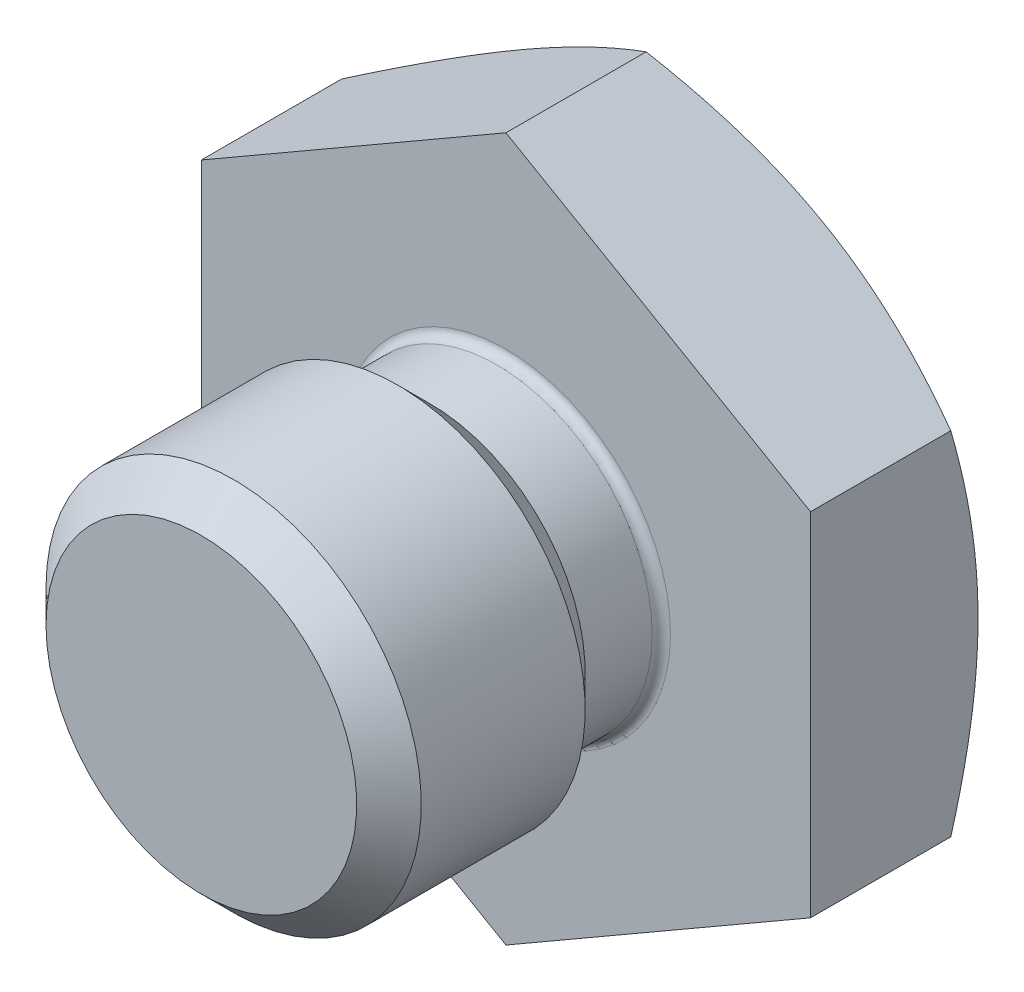
ISO-10303-21;
HEADER;
FILE_DESCRIPTION(('STEP AP214'),'2;1');
FILE_NAME('part.step','',(''),(''),'','','');
FILE_SCHEMA(('AUTOMOTIVE_DESIGN { 1 0 10303 214 1 1 1 1 }'));
ENDSEC;
DATA;
#1=APPLICATION_CONTEXT('core data for automotive mechanical design processes');
#2=APPLICATION_PROTOCOL_DEFINITION('international standard','automotive_design',2000,#1);
#3=PRODUCT_CONTEXT('',#1,'mechanical');
#4=PRODUCT('Part','Part','',(#3));
#5=PRODUCT_RELATED_PRODUCT_CATEGORY('part','',(#4));
#6=PRODUCT_DEFINITION_FORMATION('','',#4);
#7=PRODUCT_DEFINITION_CONTEXT('part definition',#1,'design');
#8=PRODUCT_DEFINITION('design','',#6,#7);
#9=PRODUCT_DEFINITION_SHAPE('','',#8);
#10=(LENGTH_UNIT() NAMED_UNIT(*) SI_UNIT(.MILLI.,.METRE.));
#11=(NAMED_UNIT(*) PLANE_ANGLE_UNIT() SI_UNIT($,.RADIAN.));
#12=(NAMED_UNIT(*) SI_UNIT($,.STERADIAN.) SOLID_ANGLE_UNIT());
#13=UNCERTAINTY_MEASURE_WITH_UNIT(LENGTH_MEASURE(1.E-05),#10,'distance_accuracy_value','');
#14=(GEOMETRIC_REPRESENTATION_CONTEXT(3) GLOBAL_UNCERTAINTY_ASSIGNED_CONTEXT((#13)) GLOBAL_UNIT_ASSIGNED_CONTEXT((#10,
#11,#12)) REPRESENTATION_CONTEXT('',''));
#15=CARTESIAN_POINT('',(0.,0.,0.));
#16=DIRECTION('',(0.,0.,1.));
#17=DIRECTION('',(1.,0.,0.));
#18=AXIS2_PLACEMENT_3D('',#15,#16,#17);
#19=CARTESIAN_POINT('',(0.,24.7927379627619,0.));
#20=DIRECTION('',(0.,0.,1.));
#21=DIRECTION('',(1.,0.,0.));
#22=AXIS2_PLACEMENT_3D('',#19,#20,#21);
#23=PLANE('',#22);
#24=CARTESIAN_POINT('',(0.,0.,0.));
#25=DIRECTION('',(0.,0.,1.));
#26=DIRECTION('',(1.,0.,0.));
#27=AXIS2_PLACEMENT_3D('',#24,#25,#26);
#28=CIRCLE('',#27,6.858);
#29=CARTESIAN_POINT('',(6.858,0.,0.));
#30=VERTEX_POINT('',#29);
#31=EDGE_CURVE('E42',#30,#30,#28,.F.);
#32=ORIENTED_EDGE('',*,*,#31,.T.);
#33=EDGE_LOOP('',(#32));
#34=FACE_BOUND('',#33,.T.);
#35=DIRECTION('',(0.,1.,0.));
#36=VECTOR('',#35,1.);
#37=CARTESIAN_POINT('',(12.7,-7.33234841870825,0.));
#38=LINE('',#37,#36);
#39=CARTESIAN_POINT('',(12.7,-7.33234841870825,0.));
#40=VERTEX_POINT('',#39);
#41=CARTESIAN_POINT('',(12.7,7.33234841870826,0.));
#42=VERTEX_POINT('',#41);
#43=EDGE_CURVE('E115',#40,#42,#38,.T.);
#44=ORIENTED_EDGE('',*,*,#43,.T.);
#45=DIRECTION('',(-0.866025403784439,0.5,0.));
#46=VECTOR('',#45,1.);
#47=CARTESIAN_POINT('',(12.7,7.33234841870826,0.));
#48=LINE('',#47,#46);
#49=CARTESIAN_POINT('',(0.,14.6646968374165,0.));
#50=VERTEX_POINT('',#49);
#51=EDGE_CURVE('E110',#42,#50,#48,.T.);
#52=ORIENTED_EDGE('',*,*,#51,.T.);
#53=DIRECTION('',(-0.866025403784439,-0.5,0.));
#54=VECTOR('',#53,1.);
#55=CARTESIAN_POINT('',(0.,14.6646968374165,0.));
#56=LINE('',#55,#54);
#57=CARTESIAN_POINT('',(-12.7,7.33234841870826,0.));
#58=VERTEX_POINT('',#57);
#59=EDGE_CURVE('E108',#50,#58,#56,.T.);
#60=ORIENTED_EDGE('',*,*,#59,.T.);
#61=DIRECTION('',(0.,-1.,0.));
#62=VECTOR('',#61,1.);
#63=CARTESIAN_POINT('',(-12.7,7.33234841870825,0.));
#64=LINE('',#63,#62);
#65=CARTESIAN_POINT('',(-12.7,-7.33234841870825,0.));
#66=VERTEX_POINT('',#65);
#67=EDGE_CURVE('E57',#58,#66,#64,.T.);
#68=ORIENTED_EDGE('',*,*,#67,.T.);
#69=DIRECTION('',(0.866025403784438,-0.5,0.));
#70=VECTOR('',#69,1.);
#71=CARTESIAN_POINT('',(-12.7,-7.33234841870825,0.));
#72=LINE('',#71,#70);
#73=CARTESIAN_POINT('',(0.,-14.6646968374165,0.));
#74=VERTEX_POINT('',#73);
#75=EDGE_CURVE('E97',#66,#74,#72,.T.);
#76=ORIENTED_EDGE('',*,*,#75,.T.);
#77=DIRECTION('',(0.866025403784439,0.5,0.));
#78=VECTOR('',#77,1.);
#79=CARTESIAN_POINT('',(0.,-14.6646968374165,0.));
#80=LINE('',#79,#78);
#81=EDGE_CURVE('E103',#74,#40,#80,.T.);
#82=ORIENTED_EDGE('',*,*,#81,.T.);
#83=EDGE_LOOP('',(#44,#52,#60,#68,#76,#82));
#84=FACE_BOUND('',#83,.T.);
#85=ADVANCED_FACE('F34',(#34,#84),#23,.T.);
#86=CARTESIAN_POINT('',(0.,0.,0.));
#87=DIRECTION('',(0.,0.,-1.));
#88=DIRECTION('',(-1.,0.,0.));
#89=AXIS2_PLACEMENT_3D('',#86,#87,#88);
#90=CYLINDRICAL_SURFACE('',#89,6.477);
#91=CARTESIAN_POINT('',(0.,0.,0.380999999999999));
#92=DIRECTION('',(0.,0.,1.));
#93=DIRECTION('',(1.,0.,0.));
#94=AXIS2_PLACEMENT_3D('',#91,#92,#93);
#95=CIRCLE('',#94,6.477);
#96=CARTESIAN_POINT('',(6.477,0.,0.380999999999999));
#97=VERTEX_POINT('',#96);
#98=EDGE_CURVE('E12',#97,#97,#95,.T.);
#99=ORIENTED_EDGE('',*,*,#98,.T.);
#100=EDGE_LOOP('',(#99));
#101=FACE_BOUND('',#100,.T.);
#102=CARTESIAN_POINT('',(0.,0.,3.175));
#103=DIRECTION('',(0.,0.,-1.));
#104=DIRECTION('',(-1.,0.,0.));
#105=AXIS2_PLACEMENT_3D('',#102,#103,#104);
#106=CIRCLE('',#105,6.477);
#107=CARTESIAN_POINT('',(-6.477,0.,3.175));
#108=VERTEX_POINT('',#107);
#109=EDGE_CURVE('E180',#108,#108,#106,.T.);
#110=ORIENTED_EDGE('',*,*,#109,.T.);
#111=EDGE_LOOP('',(#110));
#112=FACE_BOUND('',#111,.T.);
#113=ADVANCED_FACE('F194',(#101,#112),#90,.T.);
#114=CARTESIAN_POINT('',(0.,0.,3.175));
#115=DIRECTION('',(0.,0.,1.));
#116=DIRECTION('',(1.,0.,0.));
#117=AXIS2_PLACEMENT_3D('',#114,#115,#116);
#118=CONICAL_SURFACE('',#117,6.477,0.785398163397446);
#119=CARTESIAN_POINT('',(0.,0.,4.5212));
#120=DIRECTION('',(0.,0.,-1.));
#121=DIRECTION('',(-1.,0.,0.));
#122=AXIS2_PLACEMENT_3D('',#119,#120,#121);
#123=CIRCLE('',#122,7.8232);
#124=CARTESIAN_POINT('',(-7.8232,0.,4.5212));
#125=VERTEX_POINT('',#124);
#126=EDGE_CURVE('E177',#125,#125,#123,.T.);
#127=ORIENTED_EDGE('',*,*,#126,.T.);
#128=EDGE_LOOP('',(#127));
#129=FACE_BOUND('',#128,.T.);
#130=ORIENTED_EDGE('',*,*,#109,.F.);
#131=EDGE_LOOP('',(#130));
#132=FACE_BOUND('',#131,.T.);
#133=ADVANCED_FACE('F198',(#129,#132),#118,.T.);
#134=CARTESIAN_POINT('',(0.,0.,0.));
#135=DIRECTION('',(0.,0.,-1.));
#136=DIRECTION('',(-1.,0.,0.));
#137=AXIS2_PLACEMENT_3D('',#134,#135,#136);
#138=CYLINDRICAL_SURFACE('',#137,7.8232);
#139=CARTESIAN_POINT('',(0.,0.,11.3538));
#140=DIRECTION('',(0.,0.,-1.));
#141=DIRECTION('',(-1.,0.,0.));
#142=AXIS2_PLACEMENT_3D('',#139,#140,#141);
#143=CIRCLE('',#142,7.8232);
#144=CARTESIAN_POINT('',(-7.8232,0.,11.3538));
#145=VERTEX_POINT('',#144);
#146=EDGE_CURVE('E174',#145,#145,#143,.T.);
#147=ORIENTED_EDGE('',*,*,#146,.T.);
#148=EDGE_LOOP('',(#147));
#149=FACE_BOUND('',#148,.T.);
#150=ORIENTED_EDGE('',*,*,#126,.F.);
#151=EDGE_LOOP('',(#150));
#152=FACE_BOUND('',#151,.T.);
#153=ADVANCED_FACE('F204',(#149,#152),#138,.T.);
#154=CARTESIAN_POINT('',(0.,0.,11.3538));
#155=DIRECTION('',(0.,0.,-1.));
#156=DIRECTION('',(-1.,0.,0.));
#157=AXIS2_PLACEMENT_3D('',#154,#155,#156);
#158=CONICAL_SURFACE('',#157,7.8232,0.78539816339745);
#159=CARTESIAN_POINT('',(0.,0.,12.7));
#160=DIRECTION('',(0.,0.,-1.));
#161=DIRECTION('',(-1.,0.,0.));
#162=AXIS2_PLACEMENT_3D('',#159,#160,#161);
#163=CIRCLE('',#162,6.477);
#164=CARTESIAN_POINT('',(-6.477,0.,12.7));
#165=VERTEX_POINT('',#164);
#166=EDGE_CURVE('E171',#165,#165,#163,.T.);
#167=ORIENTED_EDGE('',*,*,#166,.T.);
#168=EDGE_LOOP('',(#167));
#169=FACE_BOUND('',#168,.T.);
#170=ORIENTED_EDGE('',*,*,#146,.F.);
#171=EDGE_LOOP('',(#170));
#172=FACE_BOUND('',#171,.T.);
#173=ADVANCED_FACE('F208',(#169,#172),#158,.T.);
#174=CARTESIAN_POINT('',(0.,6.477,12.7));
#175=DIRECTION('',(0.,0.,1.));
#176=DIRECTION('',(1.,0.,0.));
#177=AXIS2_PLACEMENT_3D('',#174,#175,#176);
#178=PLANE('',#177);
#179=ORIENTED_EDGE('',*,*,#166,.F.);
#180=EDGE_LOOP('',(#179));
#181=FACE_BOUND('',#180,.T.);
#182=ADVANCED_FACE('F151',(#181),#178,.T.);
#183=CARTESIAN_POINT('',(12.7,7.33234841870826,-14.2748));
#184=DIRECTION('',(0.5,0.866025403784439,0.));
#185=DIRECTION('',(-0.866025403784439,0.5,0.));
#186=AXIS2_PLACEMENT_3D('',#183,#184,#185);
#187=PLANE('',#186);
#188=DIRECTION('',(0.,0.,1.));
#189=VECTOR('',#188,1.);
#190=CARTESIAN_POINT('',(0.,14.6646968374165,-14.2748));
#191=LINE('',#190,#189);
#192=CARTESIAN_POINT('',(0.,14.6646968374165,-5.84742727008171));
#193=VERTEX_POINT('',#192);
#194=EDGE_CURVE('E49',#193,#50,#191,.T.);
#195=ORIENTED_EDGE('',*,*,#194,.T.);
#196=ORIENTED_EDGE('',*,*,#51,.F.);
#197=DIRECTION('',(0.,0.,1.));
#198=VECTOR('',#197,1.);
#199=CARTESIAN_POINT('',(12.7,7.33234841870826,-14.2748));
#200=LINE('',#199,#198);
#201=CARTESIAN_POINT('',(12.7,7.33234841870826,-5.84742727008171));
#202=VERTEX_POINT('',#201);
#203=EDGE_CURVE('E117',#202,#42,#200,.T.);
#204=ORIENTED_EDGE('',*,*,#203,.F.);
#205=CARTESIAN_POINT('',(-0.000199999999997635,14.6648123074703,-5.84736060262764));
#206=CARTESIAN_POINT('',(0.278941266534791,14.5036500220945,-5.94040193638859));
#207=CARTESIAN_POINT('',(0.559171334173478,14.3418591171083,-6.02922125935265));
#208=CARTESIAN_POINT('',(1.12187858818071,14.0169799325323,-6.19724230425577));
#209=CARTESIAN_POINT('',(1.40435648125937,13.8538912449232,-6.27644086298789));
#210=CARTESIAN_POINT('',(1.97210531757824,13.5261013014424,-6.42415579427661));
#211=CARTESIAN_POINT('',(2.25738122908156,13.3613971771427,-6.49264689224107));
#212=CARTESIAN_POINT('',(2.82991538377402,13.0308444288107,-6.61747619843315));
#213=CARTESIAN_POINT('',(3.11717351290779,12.8649958706284,-6.67381509997033));
#214=CARTESIAN_POINT('',(3.68631142640282,12.536403943066,-6.77194372155737));
#215=CARTESIAN_POINT('',(3.96814895696195,12.37368496893,-6.81405822830781));
#216=CARTESIAN_POINT('',(4.53311546626107,12.047501402703,-6.88467508278688));
#217=CARTESIAN_POINT('',(4.81624446975272,11.8840367963217,-6.9131771685113));
#218=CARTESIAN_POINT('',(5.3829781066111,11.5568329785227,-6.95584951930827));
#219=CARTESIAN_POINT('',(5.66658177172691,11.3930943261249,-6.97003681516653));
#220=CARTESIAN_POINT('',(6.23405091136872,11.0654658655959,-6.98377447711717));
#221=CARTESIAN_POINT('',(6.5179163775343,10.9015760622916,-6.98332529546297));
#222=CARTESIAN_POINT('',(7.04860275375998,10.5951841401224,-6.96881226671196));
#223=CARTESIAN_POINT('',(7.2954614789018,10.45266018871,-6.95651866013917));
#224=CARTESIAN_POINT('',(7.78861109923236,10.1679401226614,-6.92109405232622));
#225=CARTESIAN_POINT('',(8.03490195301739,10.0257440319297,-6.89796228450851));
#226=CARTESIAN_POINT('',(8.52678205277028,9.74175692392831,-6.84126467743672));
#227=CARTESIAN_POINT('',(8.77237054956305,9.59996633919513,-6.80769022033963));
#228=CARTESIAN_POINT('',(9.26239617071393,9.31704991491385,-6.73069630029054));
#229=CARTESIAN_POINT('',(9.50683321564427,9.1759241212234,-6.68727616804297));
#230=CARTESIAN_POINT('',(10.2488355367813,8.74752888137559,-6.54114964835315));
#231=CARTESIAN_POINT('',(10.7442520783112,8.46150000776235,-6.42387282852322));
#232=CARTESIAN_POINT('',(11.7276978284759,7.89370733917133,-6.15770230427902));
#233=CARTESIAN_POINT('',(12.2157396288466,7.61193627435154,-6.00887111232507));
#234=CARTESIAN_POINT('',(12.7002,7.33223294865442,-5.84736060262765));
#235=B_SPLINE_CURVE_WITH_KNOTS('',3,(#205,#206,#207,#208,#209,#210,#211,#212,#213,#214,#215,
#216,#217,#218,#219,#220,#221,#222,#223,#224,#225,#226,#227,#228,#229,#230,#231,#232,#233,#234),
.UNSPECIFIED.,.F.,.F.,(4,2,2,2,2,2,2,2,2,2,2,2,2,2,4),(0.,1.00647969556822,2.01328942059792,
3.02244092501022,4.03153483987122,5.01572182494245,5.99992775232577,6.98296135127794,
7.96596457544338,8.82169691243249,9.67748978406733,10.5339907821998,11.3905500215668,
13.1413367063659,14.8886867822017),.UNSPECIFIED.);
#236=EDGE_CURVE('E155',#193,#202,#235,.T.);
#237=ORIENTED_EDGE('',*,*,#236,.F.);
#238=EDGE_LOOP('',(#195,#196,#204,#237));
#239=FACE_BOUND('',#238,.T.);
#240=ADVANCED_FACE('F146',(#239),#187,.T.);
#241=CARTESIAN_POINT('',(12.7,-7.33234841870825,-14.2748));
#242=DIRECTION('',(1.,0.,0.));
#243=DIRECTION('',(0.,0.,-1.));
#244=AXIS2_PLACEMENT_3D('',#241,#242,#243);
#245=PLANE('',#244);
#246=ORIENTED_EDGE('',*,*,#203,.T.);
#247=ORIENTED_EDGE('',*,*,#43,.F.);
#248=DIRECTION('',(0.,0.,1.));
#249=VECTOR('',#248,1.);
#250=CARTESIAN_POINT('',(12.7,-7.33234841870825,-14.2748));
#251=LINE('',#250,#249);
#252=CARTESIAN_POINT('',(12.7,-7.33234841870825,-5.84742727008171));
#253=VERTEX_POINT('',#252);
#254=EDGE_CURVE('E120',#253,#40,#251,.T.);
#255=ORIENTED_EDGE('',*,*,#254,.F.);
#256=CARTESIAN_POINT('',(12.7,-19.7460675953809,-0.759301604866257));
#257=CARTESIAN_POINT('',(12.7,-19.4684257825189,-0.894118024954078));
#258=CARTESIAN_POINT('',(12.7,-19.1904594242492,-1.02826575773899));
#259=CARTESIAN_POINT('',(12.7,-18.6338098801624,-1.29507244621469));
#260=CARTESIAN_POINT('',(12.7,-18.3551266872342,-1.42773138706573));
#261=CARTESIAN_POINT('',(12.7,-17.5178266075197,-1.82328261541964));
#262=CARTESIAN_POINT('',(12.7,-16.9580407078395,-2.08370963170909));
#263=CARTESIAN_POINT('',(12.7,-15.8317177213958,-2.59781351950669));
#264=CARTESIAN_POINT('',(12.7,-15.265160505246,-2.85144639567613));
#265=CARTESIAN_POINT('',(12.7,-14.1275558886118,-3.34839797382991));
#266=CARTESIAN_POINT('',(12.7,-13.5565087007663,-3.59171716080989));
#267=CARTESIAN_POINT('',(12.7,-12.3907765072855,-4.0728399933193));
#268=CARTESIAN_POINT('',(12.7,-11.7959169120248,-4.31022280820775));
#269=CARTESIAN_POINT('',(12.7,-10.5992539920896,-4.76714513529569));
#270=CARTESIAN_POINT('',(12.7,-9.99744990018713,-4.98668265397058));
#271=CARTESIAN_POINT('',(12.7,-8.78706824029658,-5.40218760610468));
#272=CARTESIAN_POINT('',(12.7,-8.17850699769352,-5.59820221634448));
#273=CARTESIAN_POINT('',(12.7,-6.95260008477978,-5.960418182296));
#274=CARTESIAN_POINT('',(12.7,-6.33525722836453,-6.12662886573784));
#275=CARTESIAN_POINT('',(12.7,-5.40415534830501,-6.34717450659895));
#276=CARTESIAN_POINT('',(12.7,-5.09375023217555,-6.4157539747066));
#277=CARTESIAN_POINT('',(12.7,-4.47080964131924,-6.54249659224169));
#278=CARTESIAN_POINT('',(12.7,-4.15827421008162,-6.60065995365118));
#279=CARTESIAN_POINT('',(12.7,-3.53128708207127,-6.70554640403153));
#280=CARTESIAN_POINT('',(12.7,-3.21683542874665,-6.75226975140944));
#281=CARTESIAN_POINT('',(12.7,-2.58634272084758,-6.83334657072008));
#282=CARTESIAN_POINT('',(12.7,-2.27030172892544,-6.86770052644245));
#283=CARTESIAN_POINT('',(12.7,-1.64122146937044,-6.92292244754811));
#284=CARTESIAN_POINT('',(12.7,-1.32819733017599,-6.94396169580752));
#285=CARTESIAN_POINT('',(12.7,-0.701540374396617,-6.9727812548966));
#286=CARTESIAN_POINT('',(12.7,-0.387907568096028,-6.98056178783263));
#287=CARTESIAN_POINT('',(12.7,0.239412203544875,-6.98267863861888));
#288=CARTESIAN_POINT('',(12.7,0.553099169870336,-6.977014678679));
#289=CARTESIAN_POINT('',(12.7,1.17995376737451,-6.95238103947606));
#290=CARTESIAN_POINT('',(12.7,1.49312137277604,-6.933410718492));
#291=CARTESIAN_POINT('',(12.7,2.24392224040215,-6.87238224255428));
#292=CARTESIAN_POINT('',(12.7,2.68106143264044,-6.8241133888437));
#293=CARTESIAN_POINT('',(12.7,3.55211055681985,-6.70426838229003));
#294=CARTESIAN_POINT('',(12.7,3.98602005095233,-6.6326891263606));
#295=CARTESIAN_POINT('',(12.7,5.28237044023245,-6.38678119842148));
#296=CARTESIAN_POINT('',(12.7,6.13898524479455,-6.18132360942627));
#297=CARTESIAN_POINT('',(12.7,7.4205399956354,-5.82469423416341));
#298=CARTESIAN_POINT('',(12.7,7.85210786389595,-5.69597094349204));
#299=CARTESIAN_POINT('',(12.7,8.71104866362954,-5.42509310233473));
#300=CARTESIAN_POINT('',(12.7,9.13842156207091,-5.2829384461822));
#301=CARTESIAN_POINT('',(12.7,9.98911877228208,-4.98748268532982));
#302=CARTESIAN_POINT('',(12.7,10.412444270774,-4.83418496879341));
#303=CARTESIAN_POINT('',(12.7,11.0447908346861,-4.59724007609019));
#304=CARTESIAN_POINT('',(12.7,11.2551312257898,-4.5170926656447));
#305=CARTESIAN_POINT('',(12.7,11.6749853920577,-4.35465956350302));
#306=CARTESIAN_POINT('',(12.7,11.8844991650582,-4.27237386621413));
#307=CARTESIAN_POINT('',(12.7,12.4751076961362,-4.03722811448948));
#308=CARTESIAN_POINT('',(12.7,12.8552991804624,-3.88209647800966));
#309=CARTESIAN_POINT('',(12.7,13.6133797887214,-3.56629783038859));
#310=CARTESIAN_POINT('',(12.7,13.9912688497861,-3.40563066888838));
#311=CARTESIAN_POINT('',(12.7,15.1219445076116,-2.91653374335515));
#312=CARTESIAN_POINT('',(12.7,15.8716750078503,-2.58103457373043));
#313=CARTESIAN_POINT('',(12.7,17.3650221796391,-1.89597637624338));
#314=CARTESIAN_POINT('',(12.7,18.1086361345806,-1.54641146862426));
#315=CARTESIAN_POINT('',(12.7,19.5907651754962,-0.83674602368491));
#316=CARTESIAN_POINT('',(12.7,20.3292804988325,-0.47664598096259));
#317=CARTESIAN_POINT('',(12.7,21.8035339552798,0.252296192804358));
#318=CARTESIAN_POINT('',(12.7,22.5392652473245,0.62115212413371));
#319=CARTESIAN_POINT('',(12.7,24.0074918741767,1.3652567307776));
#320=CARTESIAN_POINT('',(12.7,24.7399871774367,1.74050546824277));
#321=CARTESIAN_POINT('',(12.7,26.2021717581481,2.49599671178076));
#322=CARTESIAN_POINT('',(12.7,26.9318616674886,2.87623799639639));
#323=CARTESIAN_POINT('',(12.7,28.3890806344877,3.64082822970948));
#324=CARTESIAN_POINT('',(12.7,29.1166096999753,4.0251771635009));
#325=CARTESIAN_POINT('',(12.7,31.132362598,5.09602440038554));
#326=CARTESIAN_POINT('',(12.7,32.4186793998419,5.78611160020705));
#327=CARTESIAN_POINT('',(12.7,34.98731860262,7.17387419302865));
#328=CARTESIAN_POINT('',(12.7,36.2696407225193,7.87155010506941));
#329=CARTESIAN_POINT('',(12.7,38.8268241240189,9.27011756742893));
#330=CARTESIAN_POINT('',(12.7,40.1016959153767,9.97098991292592));
#331=CARTESIAN_POINT('',(12.7,42.012186770422,11.0254611074266));
#332=CARTESIAN_POINT('',(12.7,42.648687828225,11.3774639196604));
#333=CARTESIAN_POINT('',(12.7,43.9211661720035,12.0824134477423));
#334=CARTESIAN_POINT('',(12.7,44.5571434585391,12.4353601625795));
#335=CARTESIAN_POINT('',(12.7,45.1928915877516,12.7887192632514));
#336=B_SPLINE_CURVE_WITH_KNOTS('',3,(#256,#257,#258,#259,#260,#261,#262,#263,#264,#265,#266,
#267,#268,#269,#270,#271,#272,#273,#274,#275,#276,#277,#278,#279,#280,#281,#282,#283,#284,#285,
#286,#287,#288,#289,#290,#291,#292,#293,#294,#295,#296,#297,#298,#299,#300,#301,#302,#303,#304,
#305,#306,#307,#308,#309,#310,#311,#312,#313,#314,#315,#316,#317,#318,#319,#320,#321,#322,#323,
#324,#325,#326,#327,#328,#329,#330,#331,#332,#333,#334,#335),.UNSPECIFIED.,.F.,.F.,(4,2,2,2,2,2,
2,2,2,2,2,2,2,2,2,2,2,2,2,2,2,2,2,2,2,2,2,2,2,2,2,2,2,2,2,2,2,2,2,4),(0.,0.925927054588084,
1.85186333030722,3.70400776924036,5.56614420046459,7.42819296837028,9.34940007564301,
11.2708215097055,13.1883226140778,15.105222547007,16.0587480668006,17.0122541788381,
17.9657387510913,18.9191860267571,19.860104360908,20.8010069328982,21.7419289459863,
22.6828963396964,24.0015414050804,25.3203620806163,27.9593470488783,29.3103002990336,
30.6612641782274,32.011818987366,32.6870865952153,33.3623559694102,34.5941685049134,
35.8260145259979,38.2899153694217,40.7548570956614,43.2196832842487,45.6886929319385,
48.1577265969615,50.6261670552151,53.0945985589067,57.4737687841812,61.8532404363208,
66.2177085165837,68.3997611464236,70.5818114400915),.UNSPECIFIED.);
#337=EDGE_CURVE('E163',#202,#253,#336,.F.);
#338=ORIENTED_EDGE('',*,*,#337,.F.);
#339=EDGE_LOOP('',(#246,#247,#255,#338));
#340=FACE_BOUND('',#339,.T.);
#341=ADVANCED_FACE('F150',(#340),#245,.T.);
#342=CARTESIAN_POINT('',(0.,-14.6646968374165,-14.2748));
#343=DIRECTION('',(0.5,-0.866025403784439,0.));
#344=DIRECTION('',(0.866025403784439,0.5,0.));
#345=AXIS2_PLACEMENT_3D('',#342,#343,#344);
#346=PLANE('',#345);
#347=ORIENTED_EDGE('',*,*,#254,.T.);
#348=ORIENTED_EDGE('',*,*,#81,.F.);
#349=DIRECTION('',(0.,0.,1.));
#350=VECTOR('',#349,1.);
#351=CARTESIAN_POINT('',(0.,-14.6646968374165,-14.2748));
#352=LINE('',#351,#350);
#353=CARTESIAN_POINT('',(0.,-14.6646968374165,-5.84742727008171));
#354=VERTEX_POINT('',#353);
#355=EDGE_CURVE('E93',#354,#74,#352,.T.);
#356=ORIENTED_EDGE('',*,*,#355,.F.);
#357=CARTESIAN_POINT('',(12.7002,-7.33223294865442,-5.84736060262765));
#358=CARTESIAN_POINT('',(12.4210587334652,-7.49339523403021,-5.9404019363886));
#359=CARTESIAN_POINT('',(12.1408286658265,-7.65518613901643,-6.02922125935265));
#360=CARTESIAN_POINT('',(11.5781214118193,-7.98006532359246,-6.19724230425577));
#361=CARTESIAN_POINT('',(11.2956435187406,-8.14315401120154,-6.2764408629879));
#362=CARTESIAN_POINT('',(10.7278946824218,-8.47094395468234,-6.42415579427662));
#363=CARTESIAN_POINT('',(10.4426187709184,-8.6356480789821,-6.49264689224107));
#364=CARTESIAN_POINT('',(9.87008461622598,-8.96620082731405,-6.61747619843316));
#365=CARTESIAN_POINT('',(9.58282648709221,-9.13204938549634,-6.67381509997033));
#366=CARTESIAN_POINT('',(9.01368857359718,-9.46064131305871,-6.77194372155737));
#367=CARTESIAN_POINT('',(8.73185104303806,-9.62336028719476,-6.81405822830782));
#368=CARTESIAN_POINT('',(8.16688453373893,-9.94954385342173,-6.88467508278688));
#369=CARTESIAN_POINT('',(7.88375553024728,-10.113008459803,-6.91317716851131));
#370=CARTESIAN_POINT('',(7.3170218933889,-10.440212277602,-6.95584951930827));
#371=CARTESIAN_POINT('',(7.03341822827309,-10.6039509299998,-6.97003681516653));
#372=CARTESIAN_POINT('',(6.46594908863128,-10.9315793905288,-6.98377447711717));
#373=CARTESIAN_POINT('',(6.1820836224657,-11.0954691938331,-6.98332529546297));
#374=CARTESIAN_POINT('',(5.65139724624002,-11.4018611160023,-6.96881226671196));
#375=CARTESIAN_POINT('',(5.4045385210982,-11.5443850674147,-6.95651866013917));
#376=CARTESIAN_POINT('',(4.91138890076764,-11.8291051334634,-6.92109405232623));
#377=CARTESIAN_POINT('',(4.66509804698261,-11.9713012241951,-6.89796228450851));
#378=CARTESIAN_POINT('',(4.17321794722971,-12.2552883321964,-6.84126467743673));
#379=CARTESIAN_POINT('',(3.92762945043695,-12.3970789169296,-6.80769022033963));
#380=CARTESIAN_POINT('',(3.43760382928606,-12.6799953412109,-6.73069630029054));
#381=CARTESIAN_POINT('',(3.19316678435572,-12.8211211349013,-6.68727616804297));
#382=CARTESIAN_POINT('',(2.45116446321865,-13.2495163747492,-6.54114964835315));
#383=CARTESIAN_POINT('',(1.95574792168882,-13.5355452483624,-6.42387282852322));
#384=CARTESIAN_POINT('',(0.972302171524057,-14.1033379169534,-6.15770230427903));
#385=CARTESIAN_POINT('',(0.4842603711534,-14.3851089817732,-6.00887111232507));
#386=CARTESIAN_POINT('',(-0.000200000000005535,-14.6648123074703,-5.84736060262765));
#387=B_SPLINE_CURVE_WITH_KNOTS('',3,(#357,#358,#359,#360,#361,#362,#363,#364,#365,#366,#367,
#368,#369,#370,#371,#372,#373,#374,#375,#376,#377,#378,#379,#380,#381,#382,#383,#384,#385,#386),
.UNSPECIFIED.,.F.,.F.,(4,2,2,2,2,2,2,2,2,2,2,2,2,2,4),(0.,1.00647969556821,2.01328942059792,
3.02244092501021,4.03153483987122,5.01572182494245,5.99992775232577,6.98296135127794,
7.96596457544338,8.82169691243249,9.67748978406733,10.5339907821998,11.3905500215668,
13.1413367063659,14.8886867822017),.UNSPECIFIED.);
#388=EDGE_CURVE('E326',#253,#354,#387,.T.);
#389=ORIENTED_EDGE('',*,*,#388,.F.);
#390=EDGE_LOOP('',(#347,#348,#356,#389));
#391=FACE_BOUND('',#390,.T.);
#392=ADVANCED_FACE('F237',(#391),#346,.T.);
#393=CARTESIAN_POINT('',(-12.7,-7.33234841870825,-14.2748));
#394=DIRECTION('',(-0.5,-0.866025403784438,0.));
#395=DIRECTION('',(0.866025403784439,-0.5,0.));
#396=AXIS2_PLACEMENT_3D('',#393,#394,#395);
#397=PLANE('',#396);
#398=ORIENTED_EDGE('',*,*,#355,.T.);
#399=ORIENTED_EDGE('',*,*,#75,.F.);
#400=DIRECTION('',(0.,0.,1.));
#401=VECTOR('',#400,1.);
#402=CARTESIAN_POINT('',(-12.7,-7.33234841870825,-14.2748));
#403=LINE('',#402,#401);
#404=CARTESIAN_POINT('',(-12.7,-7.33234841870825,-5.84742727008171));
#405=VERTEX_POINT('',#404);
#406=EDGE_CURVE('E86',#405,#66,#403,.T.);
#407=ORIENTED_EDGE('',*,*,#406,.F.);
#408=CARTESIAN_POINT('',(0.000199999999995489,-14.6648123074703,-5.84736060262765));
#409=CARTESIAN_POINT('',(-0.278941266534792,-14.5036500220945,-5.9404019363886));
#410=CARTESIAN_POINT('',(-0.55917133417348,-14.3418591171083,-6.02922125935265));
#411=CARTESIAN_POINT('',(-1.12187858818071,-14.0169799325323,-6.19724230425577));
#412=CARTESIAN_POINT('',(-1.40435648125937,-13.8538912449232,-6.27644086298789));
#413=CARTESIAN_POINT('',(-1.97210531757824,-13.5261013014424,-6.42415579427661));
#414=CARTESIAN_POINT('',(-2.25738122908156,-13.3613971771426,-6.49264689224107));
#415=CARTESIAN_POINT('',(-2.82991538377402,-13.0308444288107,-6.61747619843315));
#416=CARTESIAN_POINT('',(-3.11717351290779,-12.8649958706284,-6.67381509997033));
#417=CARTESIAN_POINT('',(-3.68631142640282,-12.536403943066,-6.77194372155737));
#418=CARTESIAN_POINT('',(-3.96814895696195,-12.37368496893,-6.81405822830782));
#419=CARTESIAN_POINT('',(-4.53311546626107,-12.047501402703,-6.88467508278688));
#420=CARTESIAN_POINT('',(-4.81624446975272,-11.8840367963217,-6.91317716851131));
#421=CARTESIAN_POINT('',(-5.38297810661111,-11.5568329785227,-6.95584951930827));
#422=CARTESIAN_POINT('',(-5.66658177172691,-11.3930943261249,-6.97003681516653));
#423=CARTESIAN_POINT('',(-6.23405091136872,-11.0654658655959,-6.98377447711717));
#424=CARTESIAN_POINT('',(-6.5179163775343,-10.9015760622916,-6.98332529546297));
#425=CARTESIAN_POINT('',(-7.04860275375998,-10.5951841401224,-6.96881226671196));
#426=CARTESIAN_POINT('',(-7.2954614789018,-10.45266018871,-6.95651866013917));
#427=CARTESIAN_POINT('',(-7.78861109923236,-10.1679401226614,-6.92109405232622));
#428=CARTESIAN_POINT('',(-8.03490195301739,-10.0257440319297,-6.89796228450851));
#429=CARTESIAN_POINT('',(-8.52678205277028,-9.7417569239283,-6.84126467743673));
#430=CARTESIAN_POINT('',(-8.77237054956305,-9.59996633919513,-6.80769022033963));
#431=CARTESIAN_POINT('',(-9.26239617071393,-9.31704991491385,-6.73069630029054));
#432=CARTESIAN_POINT('',(-9.50683321564428,-9.1759241212234,-6.68727616804297));
#433=CARTESIAN_POINT('',(-10.2488355367813,-8.74752888137558,-6.54114964835315));
#434=CARTESIAN_POINT('',(-10.7442520783112,-8.46150000776234,-6.42387282852322));
#435=CARTESIAN_POINT('',(-11.7276978284759,-7.89370733917132,-6.15770230427902));
#436=CARTESIAN_POINT('',(-12.2157396288466,-7.61193627435154,-6.00887111232507));
#437=CARTESIAN_POINT('',(-12.7002,-7.33223294865441,-5.84736060262765));
#438=B_SPLINE_CURVE_WITH_KNOTS('',3,(#408,#409,#410,#411,#412,#413,#414,#415,#416,#417,#418,
#419,#420,#421,#422,#423,#424,#425,#426,#427,#428,#429,#430,#431,#432,#433,#434,#435,#436,#437),
.UNSPECIFIED.,.F.,.F.,(4,2,2,2,2,2,2,2,2,2,2,2,2,2,4),(0.,1.00647969556822,2.01328942059792,
3.02244092501022,4.03153483987122,5.01572182494245,5.99992775232578,6.98296135127794,
7.96596457544338,8.82169691243249,9.67748978406733,10.5339907821998,11.3905500215668,
13.1413367063659,14.8886867822017),.UNSPECIFIED.);
#439=EDGE_CURVE('E327',#354,#405,#438,.T.);
#440=ORIENTED_EDGE('',*,*,#439,.F.);
#441=EDGE_LOOP('',(#398,#399,#407,#440));
#442=FACE_BOUND('',#441,.T.);
#443=ADVANCED_FACE('F98',(#442),#397,.T.);
#444=CARTESIAN_POINT('',(-12.7,7.33234841870825,-14.2748));
#445=DIRECTION('',(-1.,0.,0.));
#446=DIRECTION('',(0.,0.,1.));
#447=AXIS2_PLACEMENT_3D('',#444,#445,#446);
#448=PLANE('',#447);
#449=ORIENTED_EDGE('',*,*,#406,.T.);
#450=ORIENTED_EDGE('',*,*,#67,.F.);
#451=DIRECTION('',(0.,0.,1.));
#452=VECTOR('',#451,1.);
#453=CARTESIAN_POINT('',(-12.7,7.33234841870825,-14.2748));
#454=LINE('',#453,#452);
#455=CARTESIAN_POINT('',(-12.7,7.33234841870825,-5.84742727008171));
#456=VERTEX_POINT('',#455);
#457=EDGE_CURVE('E94',#456,#58,#454,.T.);
#458=ORIENTED_EDGE('',*,*,#457,.F.);
#459=CARTESIAN_POINT('',(-12.7,-19.7460675953809,-0.759301604866255));
#460=CARTESIAN_POINT('',(-12.7,-19.4684257825189,-0.894118024954077));
#461=CARTESIAN_POINT('',(-12.7,-19.1904594242492,-1.02826575773899));
#462=CARTESIAN_POINT('',(-12.7,-18.6338098801624,-1.29507244621469));
#463=CARTESIAN_POINT('',(-12.7,-18.3551266872342,-1.42773138706573));
#464=CARTESIAN_POINT('',(-12.7,-17.5178266075197,-1.82328261541964));
#465=CARTESIAN_POINT('',(-12.7,-16.9580407078395,-2.08370963170909));
#466=CARTESIAN_POINT('',(-12.7,-15.8317177213958,-2.59781351950669));
#467=CARTESIAN_POINT('',(-12.7,-15.265160505246,-2.85144639567612));
#468=CARTESIAN_POINT('',(-12.7,-14.1275558886118,-3.34839797382991));
#469=CARTESIAN_POINT('',(-12.7,-13.5565087007663,-3.59171716080989));
#470=CARTESIAN_POINT('',(-12.7,-12.3907765072855,-4.0728399933193));
#471=CARTESIAN_POINT('',(-12.7,-11.7959169120247,-4.31022280820775));
#472=CARTESIAN_POINT('',(-12.7,-10.5992539920896,-4.76714513529568));
#473=CARTESIAN_POINT('',(-12.7,-9.99744990018712,-4.98668265397058));
#474=CARTESIAN_POINT('',(-12.7,-8.78706824029657,-5.40218760610468));
#475=CARTESIAN_POINT('',(-12.7,-8.17850699769351,-5.59820221634448));
#476=CARTESIAN_POINT('',(-12.7,-6.95260008477978,-5.960418182296));
#477=CARTESIAN_POINT('',(-12.7,-6.33525722836453,-6.12662886573784));
#478=CARTESIAN_POINT('',(-12.7,-5.40415534830501,-6.34717450659895));
#479=CARTESIAN_POINT('',(-12.7,-5.09375023217555,-6.41575397470659));
#480=CARTESIAN_POINT('',(-12.7,-4.47080964131923,-6.54249659224169));
#481=CARTESIAN_POINT('',(-12.7,-4.15827421008161,-6.60065995365117));
#482=CARTESIAN_POINT('',(-12.7,-3.53128708207127,-6.70554640403153));
#483=CARTESIAN_POINT('',(-12.7,-3.21683542874664,-6.75226975140944));
#484=CARTESIAN_POINT('',(-12.7,-2.58634272084758,-6.83334657072007));
#485=CARTESIAN_POINT('',(-12.7,-2.27030172892544,-6.86770052644245));
#486=CARTESIAN_POINT('',(-12.7,-1.64122146937044,-6.92292244754811));
#487=CARTESIAN_POINT('',(-12.7,-1.32819733017599,-6.94396169580752));
#488=CARTESIAN_POINT('',(-12.7,-0.701540374396613,-6.9727812548966));
#489=CARTESIAN_POINT('',(-12.7,-0.387907568096024,-6.98056178783262));
#490=CARTESIAN_POINT('',(-12.7,0.239412203544879,-6.98267863861888));
#491=CARTESIAN_POINT('',(-12.7,0.55309916987034,-6.977014678679));
#492=CARTESIAN_POINT('',(-12.7,1.17995376737452,-6.95238103947606));
#493=CARTESIAN_POINT('',(-12.7,1.49312137277605,-6.933410718492));
#494=CARTESIAN_POINT('',(-12.7,2.24392224040216,-6.87238224255428));
#495=CARTESIAN_POINT('',(-12.7,2.68106143264045,-6.8241133888437));
#496=CARTESIAN_POINT('',(-12.7,3.55211055681986,-6.70426838229002));
#497=CARTESIAN_POINT('',(-12.7,3.98602005095235,-6.63268912636059));
#498=CARTESIAN_POINT('',(-12.7,5.28237044023246,-6.38678119842147));
#499=CARTESIAN_POINT('',(-12.7,6.13898524479457,-6.18132360942626));
#500=CARTESIAN_POINT('',(-12.7,7.42053999563542,-5.8246942341634));
#501=CARTESIAN_POINT('',(-12.7,7.85210786389597,-5.69597094349203));
#502=CARTESIAN_POINT('',(-12.7,8.71104866362956,-5.42509310233472));
#503=CARTESIAN_POINT('',(-12.7,9.13842156207093,-5.28293844618219));
#504=CARTESIAN_POINT('',(-12.7,9.98911877228211,-4.98748268532981));
#505=CARTESIAN_POINT('',(-12.7,10.412444270774,-4.83418496879341));
#506=CARTESIAN_POINT('',(-12.7,11.0447908346861,-4.59724007609018));
#507=CARTESIAN_POINT('',(-12.7,11.2551312257898,-4.51709266564468));
#508=CARTESIAN_POINT('',(-12.7,11.6749853920577,-4.35465956350301));
#509=CARTESIAN_POINT('',(-12.7,11.8844991650582,-4.27237386621412));
#510=CARTESIAN_POINT('',(-12.7,12.4751076961362,-4.03722811448947));
#511=CARTESIAN_POINT('',(-12.7,12.8552991804624,-3.88209647800965));
#512=CARTESIAN_POINT('',(-12.7,13.6133797887215,-3.56629783038858));
#513=CARTESIAN_POINT('',(-12.7,13.9912688497861,-3.40563066888837));
#514=CARTESIAN_POINT('',(-12.7,15.1219445076116,-2.91653374335514));
#515=CARTESIAN_POINT('',(-12.7,15.8716750078504,-2.58103457373042));
#516=CARTESIAN_POINT('',(-12.7,17.3650221796391,-1.89597637624337));
#517=CARTESIAN_POINT('',(-12.7,18.1086361345807,-1.54641146862424));
#518=CARTESIAN_POINT('',(-12.7,19.5907651754962,-0.836746023684895));
#519=CARTESIAN_POINT('',(-12.7,20.3292804988325,-0.476645980962577));
#520=CARTESIAN_POINT('',(-12.7,21.8035339552798,0.252296192804368));
#521=CARTESIAN_POINT('',(-12.7,22.5392652473245,0.621152124133721));
#522=CARTESIAN_POINT('',(-12.7,24.0074918741767,1.36525673077762));
#523=CARTESIAN_POINT('',(-12.7,24.7399871774368,1.74050546824278));
#524=CARTESIAN_POINT('',(-12.7,26.2021717581481,2.49599671178077));
#525=CARTESIAN_POINT('',(-12.7,26.9318616674886,2.8762379963964));
#526=CARTESIAN_POINT('',(-12.7,28.3890806344877,3.64082822970949));
#527=CARTESIAN_POINT('',(-12.7,29.1166096999753,4.02517716350091));
#528=CARTESIAN_POINT('',(-12.7,31.132362598,5.09602440038555));
#529=CARTESIAN_POINT('',(-12.7,32.418679399842,5.78611160020707));
#530=CARTESIAN_POINT('',(-12.7,34.98731860262,7.17387419302867));
#531=CARTESIAN_POINT('',(-12.7,36.2696407225193,7.87155010506943));
#532=CARTESIAN_POINT('',(-12.7,38.8268241240189,9.27011756742894));
#533=CARTESIAN_POINT('',(-12.7,40.1016959153768,9.97098991292594));
#534=CARTESIAN_POINT('',(-12.7,42.012186770422,11.0254611074266));
#535=CARTESIAN_POINT('',(-12.7,42.648687828225,11.3774639196604));
#536=CARTESIAN_POINT('',(-12.7,43.9211661720035,12.0824134477423));
#537=CARTESIAN_POINT('',(-12.7,44.5571434585391,12.4353601625795));
#538=CARTESIAN_POINT('',(-12.7,45.1928915877516,12.7887192632514));
#539=B_SPLINE_CURVE_WITH_KNOTS('',3,(#459,#460,#461,#462,#463,#464,#465,#466,#467,#468,#469,
#470,#471,#472,#473,#474,#475,#476,#477,#478,#479,#480,#481,#482,#483,#484,#485,#486,#487,#488,
#489,#490,#491,#492,#493,#494,#495,#496,#497,#498,#499,#500,#501,#502,#503,#504,#505,#506,#507,
#508,#509,#510,#511,#512,#513,#514,#515,#516,#517,#518,#519,#520,#521,#522,#523,#524,#525,#526,
#527,#528,#529,#530,#531,#532,#533,#534,#535,#536,#537,#538),.UNSPECIFIED.,.F.,.F.,(4,2,2,2,2,2,
2,2,2,2,2,2,2,2,2,2,2,2,2,2,2,2,2,2,2,2,2,2,2,2,2,2,2,2,2,2,2,2,2,4),(0.,0.925927054588081,
1.85186333030721,3.70400776924035,5.56614420046459,7.42819296837028,9.34940007564302,
11.2708215097055,13.1883226140778,15.105222547007,16.0587480668005,17.0122541788381,
17.9657387510913,18.9191860267571,19.860104360908,20.8010069328982,21.7419289459863,
22.6828963396964,24.0015414050804,25.3203620806163,27.9593470488783,29.3103002990336,
30.6612641782274,32.0118189873661,32.6870865952153,33.3623559694103,34.5941685049135,
35.8260145259979,38.2899153694217,40.7548570956614,43.2196832842487,45.6886929319385,
48.1577265969615,50.6261670552151,53.0945985589067,57.4737687841812,61.8532404363208,
66.2177085165837,68.3997611464236,70.5818114400915),.UNSPECIFIED.);
#540=EDGE_CURVE('E90',#405,#456,#539,.T.);
#541=ORIENTED_EDGE('',*,*,#540,.F.);
#542=EDGE_LOOP('',(#449,#450,#458,#541));
#543=FACE_BOUND('',#542,.T.);
#544=ADVANCED_FACE('F88',(#543),#448,.T.);
#545=CARTESIAN_POINT('',(0.,14.6646968374165,-14.2748));
#546=DIRECTION('',(-0.5,0.866025403784439,0.));
#547=DIRECTION('',(-0.866025403784439,-0.5,0.));
#548=AXIS2_PLACEMENT_3D('',#545,#546,#547);
#549=PLANE('',#548);
#550=ORIENTED_EDGE('',*,*,#457,.T.);
#551=ORIENTED_EDGE('',*,*,#59,.F.);
#552=ORIENTED_EDGE('',*,*,#194,.F.);
#553=CARTESIAN_POINT('',(-12.7002,7.33223294865442,-5.84736060262765));
#554=CARTESIAN_POINT('',(-12.4210587334652,7.49339523403021,-5.9404019363886));
#555=CARTESIAN_POINT('',(-12.1408286658265,7.65518613901643,-6.02922125935265));
#556=CARTESIAN_POINT('',(-11.5781214118193,7.98006532359247,-6.19724230425577));
#557=CARTESIAN_POINT('',(-11.2956435187406,8.14315401120155,-6.27644086298789));
#558=CARTESIAN_POINT('',(-10.7278946824218,8.47094395468234,-6.42415579427661));
#559=CARTESIAN_POINT('',(-10.4426187709184,8.6356480789821,-6.49264689224107));
#560=CARTESIAN_POINT('',(-9.87008461622598,8.96620082731405,-6.61747619843315));
#561=CARTESIAN_POINT('',(-9.58282648709221,9.13204938549634,-6.67381509997033));
#562=CARTESIAN_POINT('',(-9.01368857359718,9.46064131305872,-6.77194372155737));
#563=CARTESIAN_POINT('',(-8.73185104303806,9.62336028719477,-6.81405822830782));
#564=CARTESIAN_POINT('',(-8.16688453373894,9.94954385342174,-6.88467508278688));
#565=CARTESIAN_POINT('',(-7.88375553024728,10.113008459803,-6.9131771685113));
#566=CARTESIAN_POINT('',(-7.3170218933889,10.440212277602,-6.95584951930826));
#567=CARTESIAN_POINT('',(-7.03341822827309,10.6039509299998,-6.97003681516653));
#568=CARTESIAN_POINT('',(-6.46594908863128,10.9315793905288,-6.98377447711717));
#569=CARTESIAN_POINT('',(-6.1820836224657,11.0954691938332,-6.98332529546297));
#570=CARTESIAN_POINT('',(-5.65139724624003,11.4018611160023,-6.96881226671195));
#571=CARTESIAN_POINT('',(-5.40453852109821,11.5443850674147,-6.95651866013917));
#572=CARTESIAN_POINT('',(-4.91138890076765,11.8291051334634,-6.92109405232622));
#573=CARTESIAN_POINT('',(-4.66509804698262,11.9713012241951,-6.89796228450851));
#574=CARTESIAN_POINT('',(-4.17321794722972,12.2552883321964,-6.84126467743672));
#575=CARTESIAN_POINT('',(-3.92762945043695,12.3970789169296,-6.80769022033963));
#576=CARTESIAN_POINT('',(-3.43760382928607,12.6799953412109,-6.73069630029054));
#577=CARTESIAN_POINT('',(-3.19316678435573,12.8211211349014,-6.68727616804297));
#578=CARTESIAN_POINT('',(-2.45116446321865,13.2495163747492,-6.54114964835315));
#579=CARTESIAN_POINT('',(-1.95574792168882,13.5355452483624,-6.42387282852322));
#580=CARTESIAN_POINT('',(-0.972302171524062,14.1033379169534,-6.15770230427902));
#581=CARTESIAN_POINT('',(-0.484260371153405,14.3851089817732,-6.00887111232507));
#582=CARTESIAN_POINT('',(0.000200000000000875,14.6648123074703,-5.84736060262765));
#583=B_SPLINE_CURVE_WITH_KNOTS('',3,(#553,#554,#555,#556,#557,#558,#559,#560,#561,#562,#563,
#564,#565,#566,#567,#568,#569,#570,#571,#572,#573,#574,#575,#576,#577,#578,#579,#580,#581,#582),
.UNSPECIFIED.,.F.,.F.,(4,2,2,2,2,2,2,2,2,2,2,2,2,2,4),(0.,1.00647969556822,2.01328942059792,
3.02244092501022,4.03153483987122,5.01572182494245,5.99992775232578,6.98296135127794,
7.96596457544338,8.82169691243249,9.67748978406733,10.5339907821998,11.3905500215668,
13.1413367063659,14.8886867822017),.UNSPECIFIED.);
#584=EDGE_CURVE('E119',#456,#193,#583,.T.);
#585=ORIENTED_EDGE('',*,*,#584,.F.);
#586=EDGE_LOOP('',(#550,#551,#552,#585));
#587=FACE_BOUND('',#586,.T.);
#588=ADVANCED_FACE('F139',(#587),#549,.T.);
#589=CARTESIAN_POINT('',(0.,0.,-14.0208));
#590=DIRECTION('',(0.,0.,-1.));
#591=DIRECTION('',(0.,-1.,0.));
#592=AXIS2_PLACEMENT_3D('',#589,#590,#591);
#593=SPHERICAL_SURFACE('',#592,0.254000000000001);
#594=CARTESIAN_POINT('',(0.,0.,-14.2407704525613));
#595=DIRECTION('',(0.,0.,-1.));
#596=DIRECTION('',(-1.,0.,0.));
#597=AXIS2_PLACEMENT_3D('',#594,#595,#596);
#598=CIRCLE('',#597,0.127);
#599=CARTESIAN_POINT('',(-0.127,0.,-14.2407704525613));
#600=VERTEX_POINT('',#599);
#601=EDGE_CURVE('E162',#600,#600,#598,.T.);
#602=ORIENTED_EDGE('',*,*,#601,.T.);
#603=EDGE_LOOP('',(#602));
#604=FACE_BOUND('',#603,.T.);
#605=ADVANCED_FACE('F143',(#604),#593,.T.);
#606=CARTESIAN_POINT('',(0.,0.,-14.2407704525613));
#607=DIRECTION('',(0.,0.,1.));
#608=DIRECTION('',(1.,0.,0.));
#609=AXIS2_PLACEMENT_3D('',#606,#607,#608);
#610=CONICAL_SURFACE('',#609,0.127,1.0471975511966);
#611=ORIENTED_EDGE('',*,*,#601,.F.);
#612=EDGE_LOOP('',(#611));
#613=FACE_BOUND('',#612,.T.);
#614=ORIENTED_EDGE('',*,*,#584,.T.);
#615=ORIENTED_EDGE('',*,*,#236,.T.);
#616=ORIENTED_EDGE('',*,*,#337,.T.);
#617=ORIENTED_EDGE('',*,*,#388,.T.);
#618=ORIENTED_EDGE('',*,*,#439,.T.);
#619=ORIENTED_EDGE('',*,*,#540,.T.);
#620=EDGE_LOOP('',(#614,#615,#616,#617,#618,#619));
#621=FACE_BOUND('',#620,.T.);
#622=ADVANCED_FACE('F136',(#613,#621),#610,.T.);
#623=CARTESIAN_POINT('',(0.,0.,0.380999999999999));
#624=DIRECTION('',(0.,0.,1.));
#625=DIRECTION('',(1.,0.,0.));
#626=AXIS2_PLACEMENT_3D('',#623,#624,#625);
#627=TOROIDAL_SURFACE('',#626,6.858,0.381);
#628=ORIENTED_EDGE('',*,*,#98,.F.);
#629=EDGE_LOOP('',(#628));
#630=FACE_BOUND('',#629,.T.);
#631=ORIENTED_EDGE('',*,*,#31,.F.);
#632=EDGE_LOOP('',(#631));
#633=FACE_BOUND('',#632,.T.);
#634=ADVANCED_FACE('F36',(#630,#633),#627,.F.);
#635=CLOSED_SHELL('',(#85,#113,#133,#153,#173,#182,#240,#341,#392,#443,#544,#588,#605,#622,#634));
#636=MANIFOLD_SOLID_BREP('B2',#635);
#637=ADVANCED_BREP_SHAPE_REPRESENTATION('',(#18,#636),#14);
#638=SHAPE_DEFINITION_REPRESENTATION(#9,#637);
ENDSEC;
END-ISO-10303-21;
